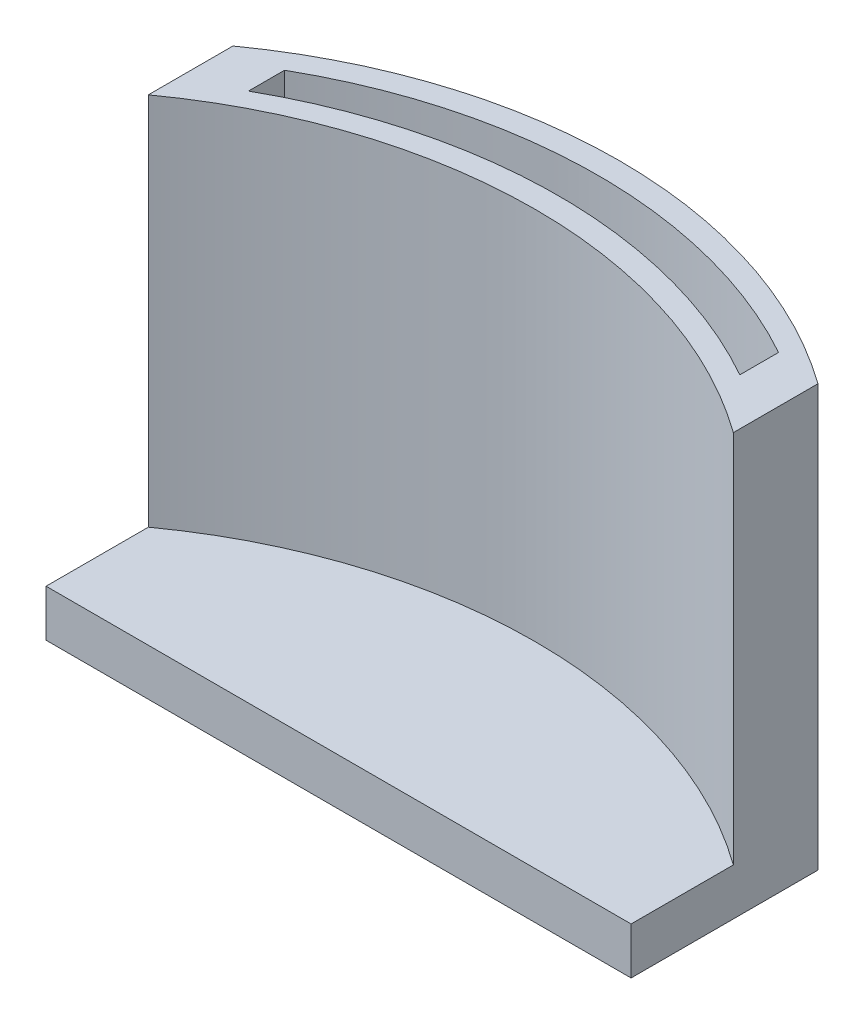
ISO-10303-21;
HEADER;
FILE_DESCRIPTION(('STEP AP214'),'2;1');
FILE_NAME('part.step','',(''),(''),'','','');
FILE_SCHEMA(('AUTOMOTIVE_DESIGN { 1 0 10303 214 1 1 1 1 }'));
ENDSEC;
DATA;
#1=APPLICATION_CONTEXT('core data for automotive mechanical design processes');
#2=APPLICATION_PROTOCOL_DEFINITION('international standard','automotive_design',2000,#1);
#3=PRODUCT_CONTEXT('',#1,'mechanical');
#4=PRODUCT('Part','Part','',(#3));
#5=PRODUCT_RELATED_PRODUCT_CATEGORY('part','',(#4));
#6=PRODUCT_DEFINITION_FORMATION('','',#4);
#7=PRODUCT_DEFINITION_CONTEXT('part definition',#1,'design');
#8=PRODUCT_DEFINITION('design','',#6,#7);
#9=PRODUCT_DEFINITION_SHAPE('','',#8);
#10=(LENGTH_UNIT() NAMED_UNIT(*) SI_UNIT(.MILLI.,.METRE.));
#11=(NAMED_UNIT(*) PLANE_ANGLE_UNIT() SI_UNIT($,.RADIAN.));
#12=(NAMED_UNIT(*) SI_UNIT($,.STERADIAN.) SOLID_ANGLE_UNIT());
#13=UNCERTAINTY_MEASURE_WITH_UNIT(LENGTH_MEASURE(1.E-05),#10,'distance_accuracy_value','');
#14=(GEOMETRIC_REPRESENTATION_CONTEXT(3) GLOBAL_UNCERTAINTY_ASSIGNED_CONTEXT((#13)) GLOBAL_UNIT_ASSIGNED_CONTEXT((#10,
#11,#12)) REPRESENTATION_CONTEXT('',''));
#15=CARTESIAN_POINT('',(0.,0.,0.));
#16=DIRECTION('',(0.,0.,1.));
#17=DIRECTION('',(1.,0.,0.));
#18=AXIS2_PLACEMENT_3D('',#15,#16,#17);
#19=CARTESIAN_POINT('',(0.,2.54,0.));
#20=DIRECTION('',(1.,0.,0.));
#21=DIRECTION('',(0.,0.,-1.));
#22=AXIS2_PLACEMENT_3D('',#19,#20,#21);
#23=PLANE('',#22);
#24=DIRECTION('',(0.,0.,1.));
#25=VECTOR('',#24,1.);
#26=CARTESIAN_POINT('',(0.,0.,0.));
#27=LINE('',#26,#25);
#28=CARTESIAN_POINT('',(0.,0.,-26.649569903975));
#29=VERTEX_POINT('',#28);
#30=CARTESIAN_POINT('',(0.,0.,-16.51));
#31=VERTEX_POINT('',#30);
#32=EDGE_CURVE('E128',#29,#31,#27,.T.);
#33=ORIENTED_EDGE('',*,*,#32,.T.);
#34=DIRECTION('',(0.,1.,0.));
#35=VECTOR('',#34,1.);
#36=CARTESIAN_POINT('',(0.,0.,-16.51));
#37=LINE('',#36,#35);
#38=CARTESIAN_POINT('',(0.,2.54,-16.51));
#39=VERTEX_POINT('',#38);
#40=EDGE_CURVE('E47',#31,#39,#37,.T.);
#41=ORIENTED_EDGE('',*,*,#40,.T.);
#42=DIRECTION('',(0.,0.,1.));
#43=VECTOR('',#42,1.);
#44=CARTESIAN_POINT('',(0.,2.54,0.));
#45=LINE('',#44,#43);
#46=CARTESIAN_POINT('',(0.,2.54,-22.0596477533074));
#47=VERTEX_POINT('',#46);
#48=EDGE_CURVE('E130',#47,#39,#45,.T.);
#49=ORIENTED_EDGE('',*,*,#48,.F.);
#50=DIRECTION('',(0.,-1.,0.));
#51=VECTOR('',#50,1.);
#52=CARTESIAN_POINT('',(0.,22.86,-22.0596477533074));
#53=LINE('',#52,#51);
#54=CARTESIAN_POINT('',(0.,22.86,-22.0596477533074));
#55=VERTEX_POINT('',#54);
#56=EDGE_CURVE('E132',#55,#47,#53,.T.);
#57=ORIENTED_EDGE('',*,*,#56,.F.);
#58=DIRECTION('',(0.,0.,1.));
#59=VECTOR('',#58,1.);
#60=CARTESIAN_POINT('',(0.,22.86,-22.0596477533074));
#61=LINE('',#60,#59);
#62=CARTESIAN_POINT('',(0.,22.86,-26.649569903975));
#63=VERTEX_POINT('',#62);
#64=EDGE_CURVE('E156',#63,#55,#61,.T.);
#65=ORIENTED_EDGE('',*,*,#64,.F.);
#66=DIRECTION('',(0.,-1.,0.));
#67=VECTOR('',#66,1.);
#68=CARTESIAN_POINT('',(0.,2.54,-26.649569903975));
#69=LINE('',#68,#67);
#70=EDGE_CURVE('E40',#63,#29,#69,.T.);
#71=ORIENTED_EDGE('',*,*,#70,.T.);
#72=EDGE_LOOP('',(#33,#41,#49,#57,#65,#71));
#73=FACE_BOUND('',#72,.T.);
#74=ADVANCED_FACE('F33',(#73),#23,.F.);
#75=CARTESIAN_POINT('',(31.75,2.54,0.));
#76=DIRECTION('',(-1.,0.,0.));
#77=DIRECTION('',(0.,0.,1.));
#78=AXIS2_PLACEMENT_3D('',#75,#76,#77);
#79=PLANE('',#78);
#80=DIRECTION('',(0.,0.,-1.));
#81=VECTOR('',#80,1.);
#82=CARTESIAN_POINT('',(31.75,2.54,0.));
#83=LINE('',#82,#81);
#84=CARTESIAN_POINT('',(31.75,2.54,-16.51));
#85=VERTEX_POINT('',#84);
#86=CARTESIAN_POINT('',(31.75,2.54,-22.0596477533074));
#87=VERTEX_POINT('',#86);
#88=EDGE_CURVE('E123',#85,#87,#83,.T.);
#89=ORIENTED_EDGE('',*,*,#88,.F.);
#90=DIRECTION('',(0.,1.,0.));
#91=VECTOR('',#90,1.);
#92=CARTESIAN_POINT('',(31.75,0.,-16.51));
#93=LINE('',#92,#91);
#94=CARTESIAN_POINT('',(31.75,0.,-16.51));
#95=VERTEX_POINT('',#94);
#96=EDGE_CURVE('E110',#95,#85,#93,.T.);
#97=ORIENTED_EDGE('',*,*,#96,.F.);
#98=DIRECTION('',(0.,0.,-1.));
#99=VECTOR('',#98,1.);
#100=CARTESIAN_POINT('',(31.75,0.,0.));
#101=LINE('',#100,#99);
#102=CARTESIAN_POINT('',(31.75,0.,-26.649569903975));
#103=VERTEX_POINT('',#102);
#104=EDGE_CURVE('E121',#95,#103,#101,.T.);
#105=ORIENTED_EDGE('',*,*,#104,.T.);
#106=DIRECTION('',(0.,-1.,0.));
#107=VECTOR('',#106,1.);
#108=CARTESIAN_POINT('',(31.75,2.54,-26.649569903975));
#109=LINE('',#108,#107);
#110=CARTESIAN_POINT('',(31.75,22.86,-26.649569903975));
#111=VERTEX_POINT('',#110);
#112=EDGE_CURVE('E11',#111,#103,#109,.T.);
#113=ORIENTED_EDGE('',*,*,#112,.F.);
#114=DIRECTION('',(0.,0.,-1.));
#115=VECTOR('',#114,1.);
#116=CARTESIAN_POINT('',(31.75,22.86,-22.0596477533074));
#117=LINE('',#116,#115);
#118=CARTESIAN_POINT('',(31.75,22.86,-22.0596477533074));
#119=VERTEX_POINT('',#118);
#120=EDGE_CURVE('E147',#119,#111,#117,.T.);
#121=ORIENTED_EDGE('',*,*,#120,.F.);
#122=DIRECTION('',(0.,-1.,0.));
#123=VECTOR('',#122,1.);
#124=CARTESIAN_POINT('',(31.75,22.86,-22.0596477533074));
#125=LINE('',#124,#123);
#126=EDGE_CURVE('E145',#119,#87,#125,.T.);
#127=ORIENTED_EDGE('',*,*,#126,.T.);
#128=EDGE_LOOP('',(#89,#97,#105,#113,#121,#127));
#129=FACE_BOUND('',#128,.T.);
#130=ADVANCED_FACE('F120',(#129),#79,.F.);
#131=CARTESIAN_POINT('',(15.875,2.54,-4.49445419993906));
#132=DIRECTION('',(0.,-1.,0.));
#133=DIRECTION('',(0.,0.,-1.));
#134=AXIS2_PLACEMENT_3D('',#131,#132,#133);
#135=CYLINDRICAL_SURFACE('',#134,27.2555458000609);
#136=CARTESIAN_POINT('',(15.875,0.,-4.49445419993906));
#137=DIRECTION('',(0.,1.,0.));
#138=DIRECTION('',(0.,0.,-1.));
#139=AXIS2_PLACEMENT_3D('',#136,#137,#138);
#140=CIRCLE('',#139,27.2555458000609);
#141=EDGE_CURVE('E127',#103,#29,#140,.T.);
#142=ORIENTED_EDGE('',*,*,#141,.T.);
#143=ORIENTED_EDGE('',*,*,#70,.F.);
#144=CARTESIAN_POINT('',(15.875,22.86,-4.49445419993906));
#145=DIRECTION('',(0.,1.,0.));
#146=DIRECTION('',(0.,0.,-1.));
#147=AXIS2_PLACEMENT_3D('',#144,#145,#146);
#148=CIRCLE('',#147,27.2555458000609);
#149=EDGE_CURVE('E150',#111,#63,#148,.T.);
#150=ORIENTED_EDGE('',*,*,#149,.F.);
#151=ORIENTED_EDGE('',*,*,#112,.T.);
#152=EDGE_LOOP('',(#142,#143,#150,#151));
#153=FACE_BOUND('',#152,.T.);
#154=ADVANCED_FACE('F201',(#153),#135,.T.);
#155=CARTESIAN_POINT('',(15.875,2.54,-4.49445419993906));
#156=DIRECTION('',(0.,-1.,0.));
#157=DIRECTION('',(0.,0.,-1.));
#158=AXIS2_PLACEMENT_3D('',#155,#156,#157);
#159=PLANE('',#158);
#160=ORIENTED_EDGE('',*,*,#48,.T.);
#161=DIRECTION('',(-1.,0.,0.));
#162=VECTOR('',#161,1.);
#163=CARTESIAN_POINT('',(0.,2.54,-16.51));
#164=LINE('',#163,#162);
#165=EDGE_CURVE('E116',#85,#39,#164,.T.);
#166=ORIENTED_EDGE('',*,*,#165,.F.);
#167=ORIENTED_EDGE('',*,*,#88,.T.);
#168=CARTESIAN_POINT('',(15.875,2.54,0.));
#169=DIRECTION('',(0.,-1.,0.));
#170=DIRECTION('',(0.,0.,-1.));
#171=AXIS2_PLACEMENT_3D('',#168,#169,#170);
#172=CIRCLE('',#171,27.178);
#173=EDGE_CURVE('E148',#47,#87,#172,.T.);
#174=ORIENTED_EDGE('',*,*,#173,.F.);
#175=EDGE_LOOP('',(#160,#166,#167,#174));
#176=FACE_BOUND('',#175,.T.);
#177=ADVANCED_FACE('F190',(#176),#159,.F.);
#178=CARTESIAN_POINT('',(15.875,0.,-4.49445419993906));
#179=DIRECTION('',(0.,-1.,0.));
#180=DIRECTION('',(0.,0.,-1.));
#181=AXIS2_PLACEMENT_3D('',#178,#179,#180);
#182=PLANE('',#181);
#183=DIRECTION('',(-1.,0.,0.));
#184=VECTOR('',#183,1.);
#185=CARTESIAN_POINT('',(0.,0.,-16.51));
#186=LINE('',#185,#184);
#187=EDGE_CURVE('E107',#95,#31,#186,.T.);
#188=ORIENTED_EDGE('',*,*,#187,.T.);
#189=ORIENTED_EDGE('',*,*,#32,.F.);
#190=ORIENTED_EDGE('',*,*,#141,.F.);
#191=ORIENTED_EDGE('',*,*,#104,.F.);
#192=EDGE_LOOP('',(#188,#189,#190,#191));
#193=FACE_BOUND('',#192,.T.);
#194=ADVANCED_FACE('F126',(#193),#182,.T.);
#195=CARTESIAN_POINT('',(15.875,22.86,-4.49445419993906));
#196=DIRECTION('',(0.,-1.,0.));
#197=DIRECTION('',(0.,0.,-1.));
#198=AXIS2_PLACEMENT_3D('',#195,#196,#197);
#199=PLANE('',#198);
#200=ORIENTED_EDGE('',*,*,#149,.T.);
#201=ORIENTED_EDGE('',*,*,#64,.T.);
#202=CARTESIAN_POINT('',(15.875,22.86,0.));
#203=DIRECTION('',(0.,-1.,0.));
#204=DIRECTION('',(0.,0.,-1.));
#205=AXIS2_PLACEMENT_3D('',#202,#203,#204);
#206=CIRCLE('',#205,27.178);
#207=EDGE_CURVE('E154',#55,#119,#206,.T.);
#208=ORIENTED_EDGE('',*,*,#207,.T.);
#209=ORIENTED_EDGE('',*,*,#120,.T.);
#210=EDGE_LOOP('',(#200,#201,#208,#209));
#211=FACE_BOUND('',#210,.T.);
#212=CARTESIAN_POINT('',(15.875,22.86,-1.27));
#213=DIRECTION('',(0.,-1.,0.));
#214=DIRECTION('',(0.,0.,-1.));
#215=AXIS2_PLACEMENT_3D('',#212,#213,#214);
#216=CIRCLE('',#215,27.178);
#217=CARTESIAN_POINT('',(2.54,22.86,-24.9516692612662));
#218=VERTEX_POINT('',#217);
#219=CARTESIAN_POINT('',(29.21,22.86,-24.9516692612662));
#220=VERTEX_POINT('',#219);
#221=EDGE_CURVE('E170',#218,#220,#216,.T.);
#222=ORIENTED_EDGE('',*,*,#221,.F.);
#223=DIRECTION('',(0.,0.,1.));
#224=VECTOR('',#223,1.);
#225=CARTESIAN_POINT('',(2.54,22.86,-26.9117064784804));
#226=LINE('',#225,#224);
#227=CARTESIAN_POINT('',(2.54,22.86,-26.9117064784804));
#228=VERTEX_POINT('',#227);
#229=EDGE_CURVE('E168',#228,#218,#226,.T.);
#230=ORIENTED_EDGE('',*,*,#229,.F.);
#231=CARTESIAN_POINT('',(16.002,22.86,-3.302));
#232=DIRECTION('',(0.,1.,0.));
#233=DIRECTION('',(0.,0.,-1.));
#234=AXIS2_PLACEMENT_3D('',#231,#232,#233);
#235=CIRCLE('',#234,27.178);
#236=CARTESIAN_POINT('',(29.21,22.86,-27.0547350004163));
#237=VERTEX_POINT('',#236);
#238=EDGE_CURVE('E181',#237,#228,#235,.T.);
#239=ORIENTED_EDGE('',*,*,#238,.F.);
#240=DIRECTION('',(0.,0.,-1.));
#241=VECTOR('',#240,1.);
#242=CARTESIAN_POINT('',(29.21,22.86,-27.0547350004163));
#243=LINE('',#242,#241);
#244=EDGE_CURVE('E184',#220,#237,#243,.T.);
#245=ORIENTED_EDGE('',*,*,#244,.F.);
#246=EDGE_LOOP('',(#222,#230,#239,#245));
#247=FACE_BOUND('',#246,.T.);
#248=ADVANCED_FACE('F198',(#211,#247),#199,.F.);
#249=CARTESIAN_POINT('',(15.875,22.86,0.));
#250=DIRECTION('',(0.,-1.,0.));
#251=DIRECTION('',(0.,0.,-1.));
#252=AXIS2_PLACEMENT_3D('',#249,#250,#251);
#253=CYLINDRICAL_SURFACE('',#252,27.178);
#254=ORIENTED_EDGE('',*,*,#173,.T.);
#255=ORIENTED_EDGE('',*,*,#126,.F.);
#256=ORIENTED_EDGE('',*,*,#207,.F.);
#257=ORIENTED_EDGE('',*,*,#56,.T.);
#258=EDGE_LOOP('',(#254,#255,#256,#257));
#259=FACE_BOUND('',#258,.T.);
#260=ADVANCED_FACE('F193',(#259),#253,.F.);
#261=CARTESIAN_POINT('',(15.875,22.86,-1.27));
#262=DIRECTION('',(0.,-1.,0.));
#263=DIRECTION('',(0.,0.,-1.));
#264=AXIS2_PLACEMENT_3D('',#261,#262,#263);
#265=CYLINDRICAL_SURFACE('',#264,27.178);
#266=CARTESIAN_POINT('',(15.875,2.54,-1.27));
#267=DIRECTION('',(0.,-1.,0.));
#268=DIRECTION('',(0.,0.,-1.));
#269=AXIS2_PLACEMENT_3D('',#266,#267,#268);
#270=CIRCLE('',#269,27.178);
#271=CARTESIAN_POINT('',(2.54,2.54,-24.9516692612662));
#272=VERTEX_POINT('',#271);
#273=CARTESIAN_POINT('',(29.21,2.54,-24.9516692612662));
#274=VERTEX_POINT('',#273);
#275=EDGE_CURVE('E177',#272,#274,#270,.T.);
#276=ORIENTED_EDGE('',*,*,#275,.F.);
#277=DIRECTION('',(0.,-1.,0.));
#278=VECTOR('',#277,1.);
#279=CARTESIAN_POINT('',(2.54,22.86,-24.9516692612662));
#280=LINE('',#279,#278);
#281=EDGE_CURVE('E166',#218,#272,#280,.T.);
#282=ORIENTED_EDGE('',*,*,#281,.F.);
#283=ORIENTED_EDGE('',*,*,#221,.T.);
#284=DIRECTION('',(0.,-1.,0.));
#285=VECTOR('',#284,1.);
#286=CARTESIAN_POINT('',(29.21,22.86,-24.9516692612662));
#287=LINE('',#286,#285);
#288=EDGE_CURVE('E151',#220,#274,#287,.T.);
#289=ORIENTED_EDGE('',*,*,#288,.T.);
#290=EDGE_LOOP('',(#276,#282,#283,#289));
#291=FACE_BOUND('',#290,.T.);
#292=ADVANCED_FACE('F266',(#291),#265,.T.);
#293=CARTESIAN_POINT('',(29.21,22.86,-27.0547350004163));
#294=DIRECTION('',(-1.,0.,0.));
#295=DIRECTION('',(0.,0.,1.));
#296=AXIS2_PLACEMENT_3D('',#293,#294,#295);
#297=PLANE('',#296);
#298=DIRECTION('',(0.,0.,-1.));
#299=VECTOR('',#298,1.);
#300=CARTESIAN_POINT('',(29.21,2.54,-27.0547350004163));
#301=LINE('',#300,#299);
#302=CARTESIAN_POINT('',(29.21,2.54,-27.0547350004163));
#303=VERTEX_POINT('',#302);
#304=EDGE_CURVE('E174',#274,#303,#301,.T.);
#305=ORIENTED_EDGE('',*,*,#304,.F.);
#306=ORIENTED_EDGE('',*,*,#288,.F.);
#307=ORIENTED_EDGE('',*,*,#244,.T.);
#308=DIRECTION('',(0.,-1.,0.));
#309=VECTOR('',#308,1.);
#310=CARTESIAN_POINT('',(29.21,22.86,-27.0547350004163));
#311=LINE('',#310,#309);
#312=EDGE_CURVE('E162',#237,#303,#311,.T.);
#313=ORIENTED_EDGE('',*,*,#312,.T.);
#314=EDGE_LOOP('',(#305,#306,#307,#313));
#315=FACE_BOUND('',#314,.T.);
#316=ADVANCED_FACE('F258',(#315),#297,.T.);
#317=CARTESIAN_POINT('',(16.002,22.86,-3.302));
#318=DIRECTION('',(0.,-1.,0.));
#319=DIRECTION('',(0.,0.,-1.));
#320=AXIS2_PLACEMENT_3D('',#317,#318,#319);
#321=CYLINDRICAL_SURFACE('',#320,27.178);
#322=CARTESIAN_POINT('',(16.002,2.54,-3.302));
#323=DIRECTION('',(0.,1.,0.));
#324=DIRECTION('',(0.,0.,-1.));
#325=AXIS2_PLACEMENT_3D('',#322,#323,#324);
#326=CIRCLE('',#325,27.178);
#327=CARTESIAN_POINT('',(2.53999999999998,2.54,-26.9117064784804));
#328=VERTEX_POINT('',#327);
#329=EDGE_CURVE('E171',#303,#328,#326,.T.);
#330=ORIENTED_EDGE('',*,*,#329,.F.);
#331=ORIENTED_EDGE('',*,*,#312,.F.);
#332=ORIENTED_EDGE('',*,*,#238,.T.);
#333=DIRECTION('',(0.,-1.,0.));
#334=VECTOR('',#333,1.);
#335=CARTESIAN_POINT('',(2.53999999999998,22.86,-26.9117064784804));
#336=LINE('',#335,#334);
#337=EDGE_CURVE('E164',#228,#328,#336,.T.);
#338=ORIENTED_EDGE('',*,*,#337,.T.);
#339=EDGE_LOOP('',(#330,#331,#332,#338));
#340=FACE_BOUND('',#339,.T.);
#341=ADVANCED_FACE('F252',(#340),#321,.F.);
#342=CARTESIAN_POINT('',(2.54,22.86,-26.9117064784804));
#343=DIRECTION('',(1.,0.,0.));
#344=DIRECTION('',(0.,0.,-1.));
#345=AXIS2_PLACEMENT_3D('',#342,#343,#344);
#346=PLANE('',#345);
#347=DIRECTION('',(0.,0.,1.));
#348=VECTOR('',#347,1.);
#349=CARTESIAN_POINT('',(2.54,2.54,-26.9117064784804));
#350=LINE('',#349,#348);
#351=EDGE_CURVE('E55',#328,#272,#350,.T.);
#352=ORIENTED_EDGE('',*,*,#351,.F.);
#353=ORIENTED_EDGE('',*,*,#337,.F.);
#354=ORIENTED_EDGE('',*,*,#229,.T.);
#355=ORIENTED_EDGE('',*,*,#281,.T.);
#356=EDGE_LOOP('',(#352,#353,#354,#355));
#357=FACE_BOUND('',#356,.T.);
#358=ADVANCED_FACE('F248',(#357),#346,.T.);
#359=ORIENTED_EDGE('',*,*,#329,.T.);
#360=ORIENTED_EDGE('',*,*,#351,.T.);
#361=ORIENTED_EDGE('',*,*,#275,.T.);
#362=ORIENTED_EDGE('',*,*,#304,.T.);
#363=EDGE_LOOP('',(#359,#360,#361,#362));
#364=FACE_BOUND('',#363,.T.);
#365=ADVANCED_FACE('F210',(#364),#159,.F.);
#366=CARTESIAN_POINT('',(0.,0.,-16.51));
#367=DIRECTION('',(0.,0.,-1.));
#368=DIRECTION('',(-1.,0.,0.));
#369=AXIS2_PLACEMENT_3D('',#366,#367,#368);
#370=PLANE('',#369);
#371=ORIENTED_EDGE('',*,*,#165,.T.);
#372=ORIENTED_EDGE('',*,*,#40,.F.);
#373=ORIENTED_EDGE('',*,*,#187,.F.);
#374=ORIENTED_EDGE('',*,*,#96,.T.);
#375=EDGE_LOOP('',(#371,#372,#373,#374));
#376=FACE_BOUND('',#375,.T.);
#377=ADVANCED_FACE('F109',(#376),#370,.F.);
#378=CLOSED_SHELL('',(#74,#130,#154,#177,#194,#248,#260,#292,#316,#341,#358,#365,#377));
#379=MANIFOLD_SOLID_BREP('B2',#378);
#380=ADVANCED_BREP_SHAPE_REPRESENTATION('',(#18,#379),#14);
#381=SHAPE_DEFINITION_REPRESENTATION(#9,#380);
ENDSEC;
END-ISO-10303-21;
